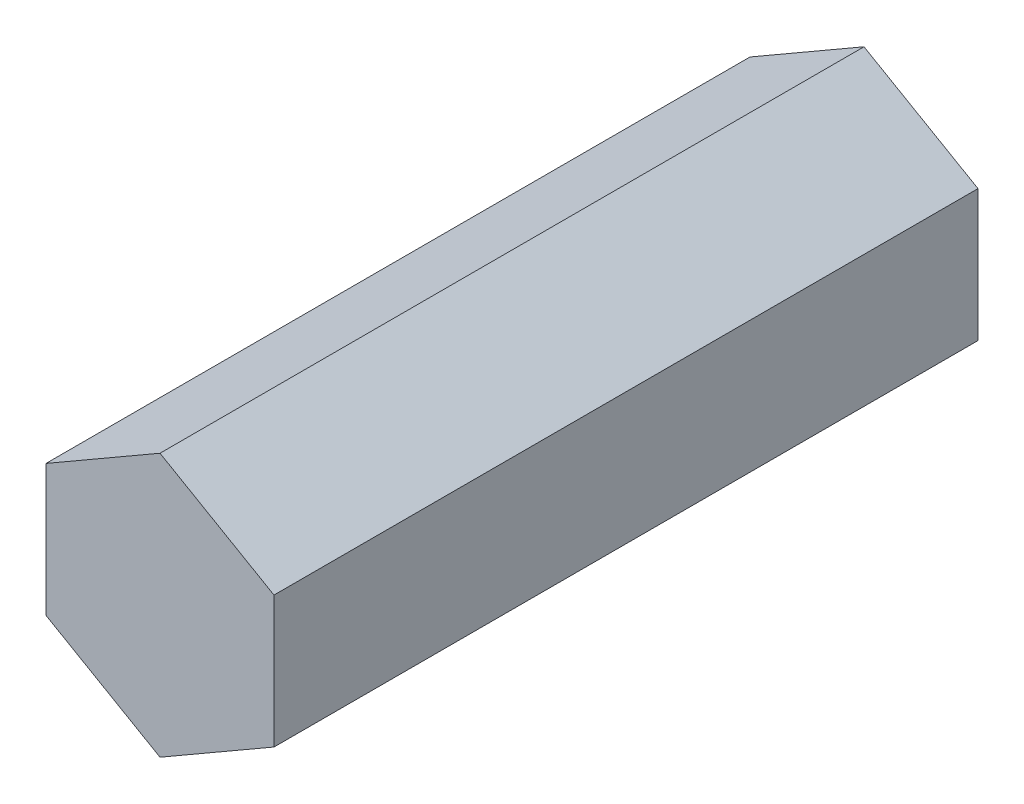
ISO-10303-21;
HEADER;
FILE_DESCRIPTION(('STEP AP214'),'2;1');
FILE_NAME('part.step','',(''),(''),'','','');
FILE_SCHEMA(('AUTOMOTIVE_DESIGN { 1 0 10303 214 1 1 1 1 }'));
ENDSEC;
DATA;
#1=APPLICATION_CONTEXT('core data for automotive mechanical design processes');
#2=APPLICATION_PROTOCOL_DEFINITION('international standard','automotive_design',2000,#1);
#3=PRODUCT_CONTEXT('',#1,'mechanical');
#4=PRODUCT('Part','Part','',(#3));
#5=PRODUCT_RELATED_PRODUCT_CATEGORY('part','',(#4));
#6=PRODUCT_DEFINITION_FORMATION('','',#4);
#7=PRODUCT_DEFINITION_CONTEXT('part definition',#1,'design');
#8=PRODUCT_DEFINITION('design','',#6,#7);
#9=PRODUCT_DEFINITION_SHAPE('','',#8);
#10=(LENGTH_UNIT() NAMED_UNIT(*) SI_UNIT(.MILLI.,.METRE.));
#11=(NAMED_UNIT(*) PLANE_ANGLE_UNIT() SI_UNIT($,.RADIAN.));
#12=(NAMED_UNIT(*) SI_UNIT($,.STERADIAN.) SOLID_ANGLE_UNIT());
#13=UNCERTAINTY_MEASURE_WITH_UNIT(LENGTH_MEASURE(1.E-05),#10,'distance_accuracy_value','');
#14=(GEOMETRIC_REPRESENTATION_CONTEXT(3) GLOBAL_UNCERTAINTY_ASSIGNED_CONTEXT((#13)) GLOBAL_UNIT_ASSIGNED_CONTEXT((#10,
#11,#12)) REPRESENTATION_CONTEXT('',''));
#15=CARTESIAN_POINT('',(0.,0.,0.));
#16=DIRECTION('',(0.,0.,1.));
#17=DIRECTION('',(1.,0.,0.));
#18=AXIS2_PLACEMENT_3D('',#15,#16,#17);
#19=CARTESIAN_POINT('',(77.0762609368489,44.5000000000196,238.));
#20=DIRECTION('',(-0.5,-0.866025403784439,0.));
#21=DIRECTION('',(0.866025403784439,-0.5,0.));
#22=AXIS2_PLACEMENT_3D('',#19,#20,#21);
#23=PLANE('',#22);
#24=DIRECTION('',(-0.866025403784439,0.5,0.));
#25=VECTOR('',#24,1.);
#26=CARTESIAN_POINT('',(77.0762609368489,44.5000000000196,-238.));
#27=LINE('',#26,#25);
#28=CARTESIAN_POINT('',(77.0762609368489,44.5000000000196,-238.));
#29=VERTEX_POINT('',#28);
#30=CARTESIAN_POINT('',(0.,89.0000000000392,-238.));
#31=VERTEX_POINT('',#30);
#32=EDGE_CURVE('E121',#29,#31,#27,.T.);
#33=ORIENTED_EDGE('',*,*,#32,.T.);
#34=DIRECTION('',(0.,0.,-1.));
#35=VECTOR('',#34,1.);
#36=CARTESIAN_POINT('',(0.,89.0000000000392,238.));
#37=LINE('',#36,#35);
#38=CARTESIAN_POINT('',(0.,89.0000000000392,238.));
#39=VERTEX_POINT('',#38);
#40=EDGE_CURVE('E11',#39,#31,#37,.T.);
#41=ORIENTED_EDGE('',*,*,#40,.F.);
#42=DIRECTION('',(-0.866025403784439,0.5,0.));
#43=VECTOR('',#42,1.);
#44=CARTESIAN_POINT('',(77.0762609368489,44.5000000000196,238.));
#45=LINE('',#44,#43);
#46=CARTESIAN_POINT('',(77.0762609368489,44.5000000000196,238.));
#47=VERTEX_POINT('',#46);
#48=EDGE_CURVE('E131',#47,#39,#45,.T.);
#49=ORIENTED_EDGE('',*,*,#48,.F.);
#50=DIRECTION('',(0.,0.,-1.));
#51=VECTOR('',#50,1.);
#52=CARTESIAN_POINT('',(77.0762609368489,44.5000000000196,238.));
#53=LINE('',#52,#51);
#54=EDGE_CURVE('E117',#47,#29,#53,.T.);
#55=ORIENTED_EDGE('',*,*,#54,.T.);
#56=EDGE_LOOP('',(#33,#41,#49,#55));
#57=FACE_BOUND('',#56,.T.);
#58=ADVANCED_FACE('F37',(#57),#23,.F.);
#59=CARTESIAN_POINT('',(0.,89.0000000000392,238.));
#60=DIRECTION('',(0.5,-0.866025403784439,0.));
#61=DIRECTION('',(0.866025403784439,0.5,0.));
#62=AXIS2_PLACEMENT_3D('',#59,#60,#61);
#63=PLANE('',#62);
#64=DIRECTION('',(-0.866025403784439,-0.5,0.));
#65=VECTOR('',#64,1.);
#66=CARTESIAN_POINT('',(0.,89.0000000000392,-238.));
#67=LINE('',#66,#65);
#68=CARTESIAN_POINT('',(-77.0762609368489,44.5000000000196,-238.));
#69=VERTEX_POINT('',#68);
#70=EDGE_CURVE('E124',#31,#69,#67,.T.);
#71=ORIENTED_EDGE('',*,*,#70,.T.);
#72=DIRECTION('',(0.,0.,-1.));
#73=VECTOR('',#72,1.);
#74=CARTESIAN_POINT('',(-77.0762609368489,44.5000000000196,238.));
#75=LINE('',#74,#73);
#76=CARTESIAN_POINT('',(-77.0762609368489,44.5000000000196,238.));
#77=VERTEX_POINT('',#76);
#78=EDGE_CURVE('E45',#77,#69,#75,.T.);
#79=ORIENTED_EDGE('',*,*,#78,.F.);
#80=DIRECTION('',(-0.866025403784439,-0.5,0.));
#81=VECTOR('',#80,1.);
#82=CARTESIAN_POINT('',(0.,89.0000000000392,238.));
#83=LINE('',#82,#81);
#84=EDGE_CURVE('E90',#39,#77,#83,.T.);
#85=ORIENTED_EDGE('',*,*,#84,.F.);
#86=ORIENTED_EDGE('',*,*,#40,.T.);
#87=EDGE_LOOP('',(#71,#79,#85,#86));
#88=FACE_BOUND('',#87,.T.);
#89=ADVANCED_FACE('F155',(#88),#63,.F.);
#90=CARTESIAN_POINT('',(-77.0762609368489,44.5000000000196,238.));
#91=DIRECTION('',(1.,0.,0.));
#92=DIRECTION('',(0.,0.,-1.));
#93=AXIS2_PLACEMENT_3D('',#90,#91,#92);
#94=PLANE('',#93);
#95=DIRECTION('',(0.,-1.,0.));
#96=VECTOR('',#95,1.);
#97=CARTESIAN_POINT('',(-77.0762609368489,44.5000000000196,-238.));
#98=LINE('',#97,#96);
#99=CARTESIAN_POINT('',(-77.0762609368489,-44.5000000000196,-238.));
#100=VERTEX_POINT('',#99);
#101=EDGE_CURVE('E126',#69,#100,#98,.T.);
#102=ORIENTED_EDGE('',*,*,#101,.T.);
#103=DIRECTION('',(0.,0.,-1.));
#104=VECTOR('',#103,1.);
#105=CARTESIAN_POINT('',(-77.0762609368489,-44.5000000000196,238.));
#106=LINE('',#105,#104);
#107=CARTESIAN_POINT('',(-77.0762609368489,-44.5000000000196,238.));
#108=VERTEX_POINT('',#107);
#109=EDGE_CURVE('E112',#108,#100,#106,.T.);
#110=ORIENTED_EDGE('',*,*,#109,.F.);
#111=DIRECTION('',(0.,-1.,0.));
#112=VECTOR('',#111,1.);
#113=CARTESIAN_POINT('',(-77.0762609368489,44.5000000000196,238.));
#114=LINE('',#113,#112);
#115=EDGE_CURVE('E103',#77,#108,#114,.T.);
#116=ORIENTED_EDGE('',*,*,#115,.F.);
#117=ORIENTED_EDGE('',*,*,#78,.T.);
#118=EDGE_LOOP('',(#102,#110,#116,#117));
#119=FACE_BOUND('',#118,.T.);
#120=ADVANCED_FACE('F137',(#119),#94,.F.);
#121=CARTESIAN_POINT('',(-77.0762609368489,-44.5000000000196,238.));
#122=DIRECTION('',(0.5,0.866025403784439,0.));
#123=DIRECTION('',(-0.866025403784439,0.5,0.));
#124=AXIS2_PLACEMENT_3D('',#121,#122,#123);
#125=PLANE('',#124);
#126=DIRECTION('',(0.866025403784439,-0.5,0.));
#127=VECTOR('',#126,1.);
#128=CARTESIAN_POINT('',(-77.0762609368489,-44.5000000000196,-238.));
#129=LINE('',#128,#127);
#130=CARTESIAN_POINT('',(0.,-89.0000000000392,-238.));
#131=VERTEX_POINT('',#130);
#132=EDGE_CURVE('E111',#100,#131,#129,.T.);
#133=ORIENTED_EDGE('',*,*,#132,.T.);
#134=DIRECTION('',(0.,0.,-1.));
#135=VECTOR('',#134,1.);
#136=CARTESIAN_POINT('',(0.,-89.0000000000392,238.));
#137=LINE('',#136,#135);
#138=CARTESIAN_POINT('',(0.,-89.0000000000392,238.));
#139=VERTEX_POINT('',#138);
#140=EDGE_CURVE('E108',#139,#131,#137,.T.);
#141=ORIENTED_EDGE('',*,*,#140,.F.);
#142=DIRECTION('',(0.866025403784439,-0.5,0.));
#143=VECTOR('',#142,1.);
#144=CARTESIAN_POINT('',(-77.0762609368489,-44.5000000000196,238.));
#145=LINE('',#144,#143);
#146=EDGE_CURVE('E97',#108,#139,#145,.T.);
#147=ORIENTED_EDGE('',*,*,#146,.F.);
#148=ORIENTED_EDGE('',*,*,#109,.T.);
#149=EDGE_LOOP('',(#133,#141,#147,#148));
#150=FACE_BOUND('',#149,.T.);
#151=ADVANCED_FACE('F109',(#150),#125,.F.);
#152=CARTESIAN_POINT('',(0.,-89.0000000000392,238.));
#153=DIRECTION('',(-0.5,0.866025403784439,0.));
#154=DIRECTION('',(-0.866025403784439,-0.5,0.));
#155=AXIS2_PLACEMENT_3D('',#152,#153,#154);
#156=PLANE('',#155);
#157=DIRECTION('',(0.866025403784439,0.5,0.));
#158=VECTOR('',#157,1.);
#159=CARTESIAN_POINT('',(0.,-89.0000000000392,-238.));
#160=LINE('',#159,#158);
#161=CARTESIAN_POINT('',(77.0762609368489,-44.5000000000196,-238.));
#162=VERTEX_POINT('',#161);
#163=EDGE_CURVE('E76',#131,#162,#160,.T.);
#164=ORIENTED_EDGE('',*,*,#163,.T.);
#165=DIRECTION('',(0.,0.,-1.));
#166=VECTOR('',#165,1.);
#167=CARTESIAN_POINT('',(77.0762609368489,-44.5000000000196,238.));
#168=LINE('',#167,#166);
#169=CARTESIAN_POINT('',(77.0762609368489,-44.5000000000196,238.));
#170=VERTEX_POINT('',#169);
#171=EDGE_CURVE('E113',#170,#162,#168,.T.);
#172=ORIENTED_EDGE('',*,*,#171,.F.);
#173=DIRECTION('',(0.866025403784439,0.5,0.));
#174=VECTOR('',#173,1.);
#175=CARTESIAN_POINT('',(0.,-89.0000000000392,238.));
#176=LINE('',#175,#174);
#177=EDGE_CURVE('E101',#139,#170,#176,.T.);
#178=ORIENTED_EDGE('',*,*,#177,.F.);
#179=ORIENTED_EDGE('',*,*,#140,.T.);
#180=EDGE_LOOP('',(#164,#172,#178,#179));
#181=FACE_BOUND('',#180,.T.);
#182=ADVANCED_FACE('F115',(#181),#156,.F.);
#183=CARTESIAN_POINT('',(77.0762609368489,-44.5000000000196,238.));
#184=DIRECTION('',(-1.,0.,0.));
#185=DIRECTION('',(0.,0.,1.));
#186=AXIS2_PLACEMENT_3D('',#183,#184,#185);
#187=PLANE('',#186);
#188=DIRECTION('',(0.,1.,0.));
#189=VECTOR('',#188,1.);
#190=CARTESIAN_POINT('',(77.0762609368489,-44.5000000000196,-238.));
#191=LINE('',#190,#189);
#192=EDGE_CURVE('E82',#162,#29,#191,.T.);
#193=ORIENTED_EDGE('',*,*,#192,.T.);
#194=ORIENTED_EDGE('',*,*,#54,.F.);
#195=DIRECTION('',(0.,1.,0.));
#196=VECTOR('',#195,1.);
#197=CARTESIAN_POINT('',(77.0762609368489,-44.5000000000196,238.));
#198=LINE('',#197,#196);
#199=EDGE_CURVE('E53',#170,#47,#198,.T.);
#200=ORIENTED_EDGE('',*,*,#199,.F.);
#201=ORIENTED_EDGE('',*,*,#171,.T.);
#202=EDGE_LOOP('',(#193,#194,#200,#201));
#203=FACE_BOUND('',#202,.T.);
#204=ADVANCED_FACE('F144',(#203),#187,.F.);
#205=CARTESIAN_POINT('',(0.,0.,238.));
#206=DIRECTION('',(0.,0.,1.));
#207=DIRECTION('',(1.,0.,0.));
#208=AXIS2_PLACEMENT_3D('',#205,#206,#207);
#209=PLANE('',#208);
#210=ORIENTED_EDGE('',*,*,#48,.T.);
#211=ORIENTED_EDGE('',*,*,#84,.T.);
#212=ORIENTED_EDGE('',*,*,#115,.T.);
#213=ORIENTED_EDGE('',*,*,#146,.T.);
#214=ORIENTED_EDGE('',*,*,#177,.T.);
#215=ORIENTED_EDGE('',*,*,#199,.T.);
#216=EDGE_LOOP('',(#210,#211,#212,#213,#214,#215));
#217=FACE_BOUND('',#216,.T.);
#218=ADVANCED_FACE('F99',(#217),#209,.T.);
#219=CARTESIAN_POINT('',(0.,0.,-238.));
#220=DIRECTION('',(0.,0.,1.));
#221=DIRECTION('',(1.,0.,0.));
#222=AXIS2_PLACEMENT_3D('',#219,#220,#221);
#223=PLANE('',#222);
#224=ORIENTED_EDGE('',*,*,#32,.F.);
#225=ORIENTED_EDGE('',*,*,#192,.F.);
#226=ORIENTED_EDGE('',*,*,#163,.F.);
#227=ORIENTED_EDGE('',*,*,#132,.F.);
#228=ORIENTED_EDGE('',*,*,#101,.F.);
#229=ORIENTED_EDGE('',*,*,#70,.F.);
#230=EDGE_LOOP('',(#224,#225,#226,#227,#228,#229));
#231=FACE_BOUND('',#230,.T.);
#232=ADVANCED_FACE('F140',(#231),#223,.F.);
#233=CLOSED_SHELL('',(#58,#89,#120,#151,#182,#204,#218,#232));
#234=MANIFOLD_SOLID_BREP('B2',#233);
#235=ADVANCED_BREP_SHAPE_REPRESENTATION('',(#18,#234),#14);
#236=SHAPE_DEFINITION_REPRESENTATION(#9,#235);
ENDSEC;
END-ISO-10303-21;
